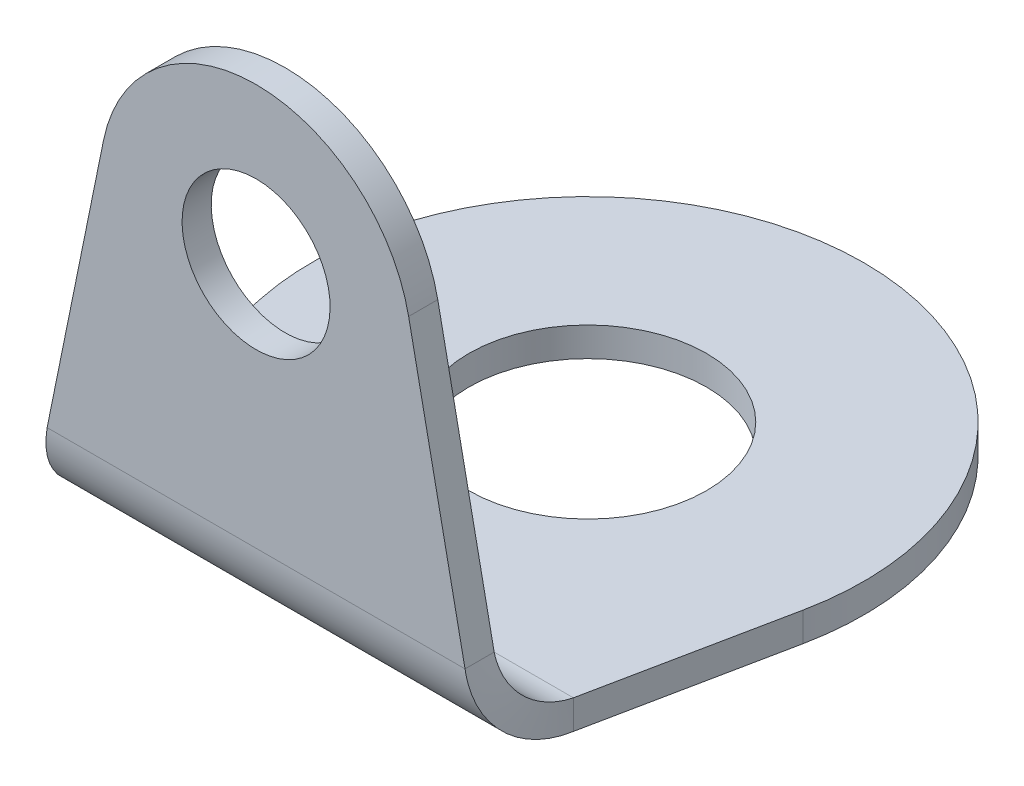
ISO-10303-21;
HEADER;
FILE_DESCRIPTION(('STEP AP214'),'2;1');
FILE_NAME('part.step','',(''),(''),'','','');
FILE_SCHEMA(('AUTOMOTIVE_DESIGN { 1 0 10303 214 1 1 1 1 }'));
ENDSEC;
DATA;
#1=APPLICATION_CONTEXT('core data for automotive mechanical design processes');
#2=APPLICATION_PROTOCOL_DEFINITION('international standard','automotive_design',2000,#1);
#3=PRODUCT_CONTEXT('',#1,'mechanical');
#4=PRODUCT('Part','Part','',(#3));
#5=PRODUCT_RELATED_PRODUCT_CATEGORY('part','',(#4));
#6=PRODUCT_DEFINITION_FORMATION('','',#4);
#7=PRODUCT_DEFINITION_CONTEXT('part definition',#1,'design');
#8=PRODUCT_DEFINITION('design','',#6,#7);
#9=PRODUCT_DEFINITION_SHAPE('','',#8);
#10=(LENGTH_UNIT() NAMED_UNIT(*) SI_UNIT(.MILLI.,.METRE.));
#11=(NAMED_UNIT(*) PLANE_ANGLE_UNIT() SI_UNIT($,.RADIAN.));
#12=(NAMED_UNIT(*) SI_UNIT($,.STERADIAN.) SOLID_ANGLE_UNIT());
#13=UNCERTAINTY_MEASURE_WITH_UNIT(LENGTH_MEASURE(1.E-05),#10,'distance_accuracy_value','');
#14=(GEOMETRIC_REPRESENTATION_CONTEXT(3) GLOBAL_UNCERTAINTY_ASSIGNED_CONTEXT((#13)) GLOBAL_UNIT_ASSIGNED_CONTEXT((#10,
#11,#12)) REPRESENTATION_CONTEXT('',''));
#15=CARTESIAN_POINT('',(0.,0.,0.));
#16=DIRECTION('',(0.,0.,1.));
#17=DIRECTION('',(1.,0.,0.));
#18=AXIS2_PLACEMENT_3D('',#15,#16,#17);
#19=CARTESIAN_POINT('',(0.,-3.92614993820408,3.94385006179594));
#20=DIRECTION('',(0.,0.,1.));
#21=DIRECTION('',(0.,-1.,0.));
#22=AXIS2_PLACEMENT_3D('',#19,#20,#21);
#23=PLANE('',#22);
#24=CARTESIAN_POINT('',(0.,3.94385006179592,3.94385006179591));
#25=DIRECTION('',(0.,0.,-1.));
#26=DIRECTION('',(0.,1.,0.));
#27=AXIS2_PLACEMENT_3D('',#24,#25,#26);
#28=CIRCLE('',#27,0.965);
#29=CARTESIAN_POINT('',(0.,4.90885006179592,3.94385006179591));
#30=VERTEX_POINT('',#29);
#31=EDGE_CURVE('E23',#30,#30,#28,.F.);
#32=ORIENTED_EDGE('',*,*,#31,.T.);
#33=EDGE_LOOP('',(#32));
#34=FACE_BOUND('',#33,.T.);
#35=DIRECTION('',(-0.199491740787802,-0.979899507785085,0.));
#36=VECTOR('',#35,1.);
#37=CARTESIAN_POINT('',(-3.52763822802631,-3.20797967136799,3.94385006179591));
#38=LINE('',#37,#36);
#39=CARTESIAN_POINT('',(-1.98919600080372,4.34881829559516,3.94385006179591));
#40=VERTEX_POINT('',#39);
#41=CARTESIAN_POINT('',(-2.72458540570571,0.736600000000003,3.94385006179592));
#42=VERTEX_POINT('',#41);
#43=EDGE_CURVE('E83',#40,#42,#38,.T.);
#44=ORIENTED_EDGE('',*,*,#43,.F.);
#45=CARTESIAN_POINT('',(0.,3.94385006179592,3.94385006179591));
#46=DIRECTION('',(0.,0.,-1.));
#47=DIRECTION('',(0.,1.,0.));
#48=AXIS2_PLACEMENT_3D('',#45,#46,#47);
#49=CIRCLE('',#48,2.03);
#50=CARTESIAN_POINT('',(1.98919600080372,4.34881829559516,3.94385006179592));
#51=VERTEX_POINT('',#50);
#52=EDGE_CURVE('E86',#51,#40,#49,.F.);
#53=ORIENTED_EDGE('',*,*,#52,.F.);
#54=DIRECTION('',(-0.199491740787802,0.979899507785085,0.));
#55=VECTOR('',#54,1.);
#56=CARTESIAN_POINT('',(3.52763822802631,-3.20797967136799,3.94385006179592));
#57=LINE('',#56,#55);
#58=CARTESIAN_POINT('',(2.72458540570571,0.7366,3.94385006179592));
#59=VERTEX_POINT('',#58);
#60=EDGE_CURVE('E88',#59,#51,#57,.T.);
#61=ORIENTED_EDGE('',*,*,#60,.F.);
#62=DIRECTION('',(-1.,0.,0.));
#63=VECTOR('',#62,1.);
#64=CARTESIAN_POINT('',(6.22625638232033,0.7366,3.94385006179592));
#65=LINE('',#64,#63);
#66=EDGE_CURVE('E117',#59,#42,#65,.T.);
#67=ORIENTED_EDGE('',*,*,#66,.T.);
#68=EDGE_LOOP('',(#44,#53,#61,#67));
#69=FACE_BOUND('',#68,.T.);
#70=ADVANCED_FACE('F17',(#34,#69),#23,.F.);
#71=CARTESIAN_POINT('',(0.,3.94385006179592,4.32385006179591));
#72=DIRECTION('',(0.,0.,-1.));
#73=DIRECTION('',(0.,1.,0.));
#74=AXIS2_PLACEMENT_3D('',#71,#72,#73);
#75=CYLINDRICAL_SURFACE('',#74,0.965);
#76=ORIENTED_EDGE('',*,*,#31,.F.);
#77=EDGE_LOOP('',(#76));
#78=FACE_BOUND('',#77,.T.);
#79=CARTESIAN_POINT('',(0.,3.94385006179592,4.32385006179591));
#80=DIRECTION('',(0.,0.,-1.));
#81=DIRECTION('',(0.,1.,0.));
#82=AXIS2_PLACEMENT_3D('',#79,#80,#81);
#83=CIRCLE('',#82,0.965);
#84=CARTESIAN_POINT('',(0.,4.90885006179592,4.32385006179591));
#85=VERTEX_POINT('',#84);
#86=EDGE_CURVE('E161',#85,#85,#83,.T.);
#87=ORIENTED_EDGE('',*,*,#86,.F.);
#88=EDGE_LOOP('',(#87));
#89=FACE_BOUND('',#88,.T.);
#90=ADVANCED_FACE('F260',(#78,#89),#75,.F.);
#91=CARTESIAN_POINT('',(-3.52763822802631,-3.20797967136799,4.32385006179594));
#92=DIRECTION('',(-0.979899507785085,0.199491740787802,0.));
#93=DIRECTION('',(-0.199491740787802,-0.979899507785085,0.));
#94=AXIS2_PLACEMENT_3D('',#91,#92,#93);
#95=PLANE('',#94);
#96=DIRECTION('',(-0.199491740787801,-0.979899507785085,0.));
#97=VECTOR('',#96,1.);
#98=CARTESIAN_POINT('',(-1.98919600080372,4.34881829559516,4.32385006179591));
#99=LINE('',#98,#97);
#100=CARTESIAN_POINT('',(-1.98919600080372,4.34881829559516,4.32385006179591));
#101=VERTEX_POINT('',#100);
#102=CARTESIAN_POINT('',(-2.72458540570571,0.736600000000003,4.32385006179592));
#103=VERTEX_POINT('',#102);
#104=EDGE_CURVE('E152',#101,#103,#99,.T.);
#105=ORIENTED_EDGE('',*,*,#104,.F.);
#106=DIRECTION('',(0.,0.,-1.));
#107=VECTOR('',#106,1.);
#108=CARTESIAN_POINT('',(-1.98919600080372,4.34881829559516,4.32385006179591));
#109=LINE('',#108,#107);
#110=EDGE_CURVE('E93',#40,#101,#109,.F.);
#111=ORIENTED_EDGE('',*,*,#110,.F.);
#112=ORIENTED_EDGE('',*,*,#43,.T.);
#113=DIRECTION('',(0.,0.,1.));
#114=VECTOR('',#113,1.);
#115=CARTESIAN_POINT('',(-2.72458540570571,0.736600000000006,4.32385006179594));
#116=LINE('',#115,#114);
#117=EDGE_CURVE('E103',#42,#103,#116,.T.);
#118=ORIENTED_EDGE('',*,*,#117,.T.);
#119=EDGE_LOOP('',(#105,#111,#112,#118));
#120=FACE_BOUND('',#119,.T.);
#121=ADVANCED_FACE('F255',(#120),#95,.T.);
#122=CARTESIAN_POINT('',(3.52763822802631,-3.20797967136799,4.32385006179594));
#123=DIRECTION('',(0.979899507785085,0.199491740787802,0.));
#124=DIRECTION('',(-0.199491740787802,0.979899507785085,0.));
#125=AXIS2_PLACEMENT_3D('',#122,#123,#124);
#126=PLANE('',#125);
#127=ORIENTED_EDGE('',*,*,#60,.T.);
#128=DIRECTION('',(0.,0.,-1.));
#129=VECTOR('',#128,1.);
#130=CARTESIAN_POINT('',(1.98919600080372,4.34881829559516,4.32385006179591));
#131=LINE('',#130,#129);
#132=CARTESIAN_POINT('',(1.98919600080372,4.34881829559516,4.32385006179591));
#133=VERTEX_POINT('',#132);
#134=EDGE_CURVE('E94',#133,#51,#131,.T.);
#135=ORIENTED_EDGE('',*,*,#134,.F.);
#136=DIRECTION('',(-0.199491740787802,0.979899507785085,0.));
#137=VECTOR('',#136,1.);
#138=CARTESIAN_POINT('',(2.72458540570571,0.736600000000004,4.32385006179592));
#139=LINE('',#138,#137);
#140=CARTESIAN_POINT('',(2.72458540570571,0.736600000000002,4.32385006179592));
#141=VERTEX_POINT('',#140);
#142=EDGE_CURVE('E154',#141,#133,#139,.T.);
#143=ORIENTED_EDGE('',*,*,#142,.F.);
#144=DIRECTION('',(0.,0.,1.));
#145=VECTOR('',#144,1.);
#146=CARTESIAN_POINT('',(2.72458540570571,0.7366,4.13385006179592));
#147=LINE('',#146,#145);
#148=EDGE_CURVE('E101',#59,#141,#147,.T.);
#149=ORIENTED_EDGE('',*,*,#148,.F.);
#150=EDGE_LOOP('',(#127,#135,#143,#149));
#151=FACE_BOUND('',#150,.T.);
#152=ADVANCED_FACE('F98',(#151),#126,.T.);
#153=CARTESIAN_POINT('',(0.,3.94385006179592,4.32385006179591));
#154=DIRECTION('',(0.,0.,-1.));
#155=DIRECTION('',(0.,1.,0.));
#156=AXIS2_PLACEMENT_3D('',#153,#154,#155);
#157=CYLINDRICAL_SURFACE('',#156,2.03);
#158=ORIENTED_EDGE('',*,*,#52,.T.);
#159=ORIENTED_EDGE('',*,*,#110,.T.);
#160=CARTESIAN_POINT('',(0.,3.94385006179592,4.32385006179591));
#161=DIRECTION('',(0.,0.,-1.));
#162=DIRECTION('',(0.,1.,0.));
#163=AXIS2_PLACEMENT_3D('',#160,#161,#162);
#164=CIRCLE('',#163,2.03);
#165=EDGE_CURVE('E107',#133,#101,#164,.F.);
#166=ORIENTED_EDGE('',*,*,#165,.F.);
#167=ORIENTED_EDGE('',*,*,#134,.T.);
#168=EDGE_LOOP('',(#158,#159,#166,#167));
#169=FACE_BOUND('',#168,.T.);
#170=ADVANCED_FACE('F105',(#169),#157,.T.);
#171=CARTESIAN_POINT('',(6.22625638232033,0.7366,3.20725006179592));
#172=DIRECTION('',(-1.,0.,0.));
#173=DIRECTION('',(0.,0.,1.));
#174=AXIS2_PLACEMENT_3D('',#171,#172,#173);
#175=CYLINDRICAL_SURFACE('',#174,0.7366);
#176=CARTESIAN_POINT('',(-2.7245854057057,0.7366,3.94385006179592));
#177=CARTESIAN_POINT('',(-2.72767203391088,0.724547398513028,3.94385031746151));
#178=CARTESIAN_POINT('',(-2.73075866211606,0.712494818780693,3.94355425585031));
#179=CARTESIAN_POINT('',(-2.73693191852642,0.688418683400155,3.942371333823));
#180=CARTESIAN_POINT('',(-2.74001854673159,0.676395127751952,3.94148447340688));
#181=CARTESIAN_POINT('',(-2.74619180314195,0.652406021114539,3.93912178951844));
#182=CARTESIAN_POINT('',(-2.74927843134713,0.640440470125329,3.93764596604611));
#183=CARTESIAN_POINT('',(-2.75545168775749,0.616596194907032,3.93410899202585));
#184=CARTESIAN_POINT('',(-2.75853831596266,0.604717470677944,3.93204784147792));
#185=CARTESIAN_POINT('',(-2.76471157237302,0.581075466927895,3.92734515720396));
#186=CARTESIAN_POINT('',(-2.7677982005782,0.569312187406933,3.92470362347792));
#187=CARTESIAN_POINT('',(-2.77397145698856,0.545929411559579,3.91884654232013));
#188=CARTESIAN_POINT('',(-2.77705808519373,0.534309915233187,3.91563099488838));
#189=CARTESIAN_POINT('',(-2.78323134160409,0.511242698235539,3.90863363130415));
#190=CARTESIAN_POINT('',(-2.78631796980927,0.499794977564283,3.90485181515168));
#191=CARTESIAN_POINT('',(-2.79249122621963,0.477098890418298,3.89673102526779));
#192=CARTESIAN_POINT('',(-2.7955778544248,0.465850523943568,3.89239205153638));
#193=CARTESIAN_POINT('',(-2.80175111083516,0.443580243496181,3.88316739935109));
#194=CARTESIAN_POINT('',(-2.80483773904034,0.432558329523524,3.8782817208972));
#195=CARTESIAN_POINT('',(-2.81101099545069,0.410767506834983,3.8679754293241));
#196=CARTESIAN_POINT('',(-2.81409762365587,0.3999985981191,3.86255481620489));
#197=CARTESIAN_POINT('',(-2.82027088006623,0.37873972918884,3.85119171402495));
#198=CARTESIAN_POINT('',(-2.82335750827141,0.368249768974464,3.84524922496422));
#199=CARTESIAN_POINT('',(-2.82953076468177,0.347574068280082,3.83285668688003));
#200=CARTESIAN_POINT('',(-2.83261739288694,0.337388327800076,3.82640663785656));
#201=CARTESIAN_POINT('',(-2.8387906492973,0.317345604915445,3.81301451857939));
#202=CARTESIAN_POINT('',(-2.84187727750248,0.30748862251082,3.80607244832568));
#203=CARTESIAN_POINT('',(-2.84805053391284,0.288127162110926,3.79171301064345));
#204=CARTESIAN_POINT('',(-2.85113716211801,0.278622684115657,3.78429564321494));
#205=CARTESIAN_POINT('',(-2.85731041852837,0.25998912965446,3.76900348027089));
#206=CARTESIAN_POINT('',(-2.86039704673355,0.250860053188533,3.76112868475535));
#207=CARTESIAN_POINT('',(-2.86657030314391,0.232999294530839,3.74494063670942));
#208=CARTESIAN_POINT('',(-2.86965693134908,0.224267612339072,3.73662738417902));
#209=CARTESIAN_POINT('',(-2.87583018775944,0.207222677616905,3.71958244945685));
#210=CARTESIAN_POINT('',(-2.87891681596462,0.198909425086505,3.71085076726508));
#211=CARTESIAN_POINT('',(-2.88509007237497,0.182721377040568,3.69299000860739));
#212=CARTESIAN_POINT('',(-2.88817670058015,0.174846581525032,3.68386093214146));
#213=CARTESIAN_POINT('',(-2.89434995699051,0.159554418580983,3.66522737768026));
#214=CARTESIAN_POINT('',(-2.89743658519569,0.152137051152469,3.655722899685));
#215=CARTESIAN_POINT('',(-2.90360984160604,0.137777613470244,3.6363614392851));
#216=CARTESIAN_POINT('',(-2.90669646981122,0.130835543216532,3.62650445688048));
#217=CARTESIAN_POINT('',(-2.91286972622158,0.117443423939358,3.60646173399585));
#218=CARTESIAN_POINT('',(-2.91595635442676,0.110993374915896,3.59627599351584));
#219=CARTESIAN_POINT('',(-2.92212961083711,0.0986008368317028,3.57560029282146));
#220=CARTESIAN_POINT('',(-2.92521623904229,0.0926583477709719,3.56511033260708));
#221=CARTESIAN_POINT('',(-2.93138949545265,0.0812952455910308,3.54385146367682));
#222=CARTESIAN_POINT('',(-2.93447612365783,0.0758746324718206,3.53308255496094));
#223=CARTESIAN_POINT('',(-2.94064938006819,0.0655683408987223,3.5112917322724));
#224=CARTESIAN_POINT('',(-2.94373600827336,0.0606826624448342,3.50026981829974));
#225=CARTESIAN_POINT('',(-2.94990926468372,0.0514580102595376,3.47799953785235));
#226=CARTESIAN_POINT('',(-2.9529958928889,0.0471190365281292,3.46675117137762));
#227=CARTESIAN_POINT('',(-2.95916914929926,0.038998246644244,3.44405508423164));
#228=CARTESIAN_POINT('',(-2.96225577750443,0.0352164304917673,3.43260736356038));
#229=CARTESIAN_POINT('',(-2.96842903391479,0.0282190669075419,3.40954014656274));
#230=CARTESIAN_POINT('',(-2.97151566211997,0.0250035194757932,3.39792065023634));
#231=CARTESIAN_POINT('',(-2.97768891853033,0.019146438318004,3.37453787438899));
#232=CARTESIAN_POINT('',(-2.9807755467355,0.0165049045919635,3.36277459486803));
#233=CARTESIAN_POINT('',(-2.98694880314586,0.011802220317997,3.33913259111798));
#234=CARTESIAN_POINT('',(-2.99003543135104,0.00974106977007098,3.32725386688889));
#235=CARTESIAN_POINT('',(-2.99620868776139,0.00620409574981292,3.30340959167059));
#236=CARTESIAN_POINT('',(-2.99929531596657,0.00472827227748086,3.29144404068138));
#237=CARTESIAN_POINT('',(-3.00546857237693,0.00236558838903799,3.26745493404397));
#238=CARTESIAN_POINT('',(-3.00855520058211,0.00147872797292718,3.25543137839577));
#239=CARTESIAN_POINT('',(-3.01472845699247,0.000295805945612161,3.23135524301523));
#240=CARTESIAN_POINT('',(-3.01781508519764,-2.55665592057032E-07,3.21930266328289));
#241=CARTESIAN_POINT('',(-3.02090171340282,0.,3.20725006179592));
#242=B_SPLINE_CURVE_WITH_KNOTS('',3,(#176,#177,#178,#179,#180,#181,#182,#183,#184,#185,#186,
#187,#188,#189,#190,#191,#192,#193,#194,#195,#196,#197,#198,#199,#200,#201,#202,#203,#204,#205,
#206,#207,#208,#209,#210,#211,#212,#213,#214,#215,#216,#217,#218,#219,#220,#221,#222,#223,#224,
#225,#226,#227,#228,#229,#230,#231,#232,#233,#234,#235,#236,#237,#238,#239,#240,#241),
.UNSPECIFIED.,.F.,.F.,(4,2,2,2,2,2,2,2,2,2,2,2,2,2,2,2,2,2,2,2,2,2,2,2,2,2,2,2,2,2,2,2,4),(0.,
0.0373211353992559,0.0746422707985128,0.111963406197768,0.149284541597024,0.186605676996281,
0.223926812395537,0.261247947794792,0.29856908319405,0.335890218593305,0.373211353992562,
0.410532489391818,0.447853624791073,0.48517476019033,0.522495895589586,0.559817030988842,
0.597138166388098,0.634459301787355,0.671780437186611,0.709101572585867,0.746422707985123,
0.783743843384379,0.821064978783635,0.858386114182891,0.895707249582147,0.933028384981404,
0.97034952038066,1.00767065577992,1.04499179117917,1.08231292657843,1.11963406197768,
1.15695519737694,1.1942763327762),.UNSPECIFIED.);
#243=CARTESIAN_POINT('',(-3.02090171340282,0.,3.20725006179592));
#244=VERTEX_POINT('',#243);
#245=EDGE_CURVE('E135',#42,#244,#242,.T.);
#246=ORIENTED_EDGE('',*,*,#245,.F.);
#247=ORIENTED_EDGE('',*,*,#66,.F.);
#248=CARTESIAN_POINT('',(3.02090171340282,0.,3.20725006179592));
#249=CARTESIAN_POINT('',(3.01781508519764,-2.55665592075732E-07,3.21930266328289));
#250=CARTESIAN_POINT('',(3.01472845699247,0.000295805945612146,3.23135524301523));
#251=CARTESIAN_POINT('',(3.00855520058211,0.00147872797292718,3.25543137839577));
#252=CARTESIAN_POINT('',(3.00546857237693,0.002365588389038,3.26745493404397));
#253=CARTESIAN_POINT('',(2.99929531596658,0.00472827227748087,3.29144404068138));
#254=CARTESIAN_POINT('',(2.9962086877614,0.00620409574981294,3.30340959167059));
#255=CARTESIAN_POINT('',(2.99003543135104,0.00974106977007097,3.32725386688889));
#256=CARTESIAN_POINT('',(2.98694880314586,0.0118022203179969,3.33913259111798));
#257=CARTESIAN_POINT('',(2.98077554673551,0.0165049045919634,3.36277459486803));
#258=CARTESIAN_POINT('',(2.97768891853033,0.019146438318004,3.37453787438899));
#259=CARTESIAN_POINT('',(2.97151566211997,0.0250035194757932,3.39792065023634));
#260=CARTESIAN_POINT('',(2.96842903391479,0.0282190669075419,3.40954014656274));
#261=CARTESIAN_POINT('',(2.96225577750444,0.0352164304917673,3.43260736356038));
#262=CARTESIAN_POINT('',(2.95916914929926,0.038998246644244,3.44405508423164));
#263=CARTESIAN_POINT('',(2.9529958928889,0.0471190365281292,3.46675117137762));
#264=CARTESIAN_POINT('',(2.94990926468372,0.0514580102595377,3.47799953785235));
#265=CARTESIAN_POINT('',(2.94373600827337,0.0606826624448342,3.50026981829974));
#266=CARTESIAN_POINT('',(2.94064938006819,0.0655683408987222,3.5112917322724));
#267=CARTESIAN_POINT('',(2.93447612365783,0.0758746324718205,3.53308255496094));
#268=CARTESIAN_POINT('',(2.93138949545265,0.0812952455910308,3.54385146367682));
#269=CARTESIAN_POINT('',(2.9252162390423,0.092658347770972,3.56511033260708));
#270=CARTESIAN_POINT('',(2.92212961083712,0.0986008368317028,3.57560029282146));
#271=CARTESIAN_POINT('',(2.91595635442676,0.110993374915896,3.59627599351584));
#272=CARTESIAN_POINT('',(2.91286972622158,0.117443423939358,3.60646173399585));
#273=CARTESIAN_POINT('',(2.90669646981123,0.130835543216532,3.62650445688048));
#274=CARTESIAN_POINT('',(2.90360984160605,0.137777613470244,3.6363614392851));
#275=CARTESIAN_POINT('',(2.89743658519569,0.152137051152469,3.655722899685));
#276=CARTESIAN_POINT('',(2.89434995699051,0.159554418580983,3.66522737768026));
#277=CARTESIAN_POINT('',(2.88817670058016,0.174846581525032,3.68386093214146));
#278=CARTESIAN_POINT('',(2.88509007237498,0.182721377040568,3.69299000860739));
#279=CARTESIAN_POINT('',(2.87891681596462,0.198909425086505,3.71085076726508));
#280=CARTESIAN_POINT('',(2.87583018775944,0.207222677616905,3.71958244945685));
#281=CARTESIAN_POINT('',(2.86965693134909,0.224267612339072,3.73662738417902));
#282=CARTESIAN_POINT('',(2.86657030314391,0.232999294530839,3.74494063670942));
#283=CARTESIAN_POINT('',(2.86039704673355,0.250860053188533,3.76112868475535));
#284=CARTESIAN_POINT('',(2.85731041852837,0.25998912965446,3.76900348027089));
#285=CARTESIAN_POINT('',(2.85113716211802,0.278622684115657,3.78429564321494));
#286=CARTESIAN_POINT('',(2.84805053391284,0.288127162110926,3.79171301064345));
#287=CARTESIAN_POINT('',(2.84187727750248,0.30748862251082,3.80607244832568));
#288=CARTESIAN_POINT('',(2.83879064929731,0.317345604915445,3.81301451857939));
#289=CARTESIAN_POINT('',(2.83261739288695,0.337388327800076,3.82640663785656));
#290=CARTESIAN_POINT('',(2.82953076468177,0.347574068280082,3.83285668688003));
#291=CARTESIAN_POINT('',(2.82335750827141,0.368249768974464,3.84524922496422));
#292=CARTESIAN_POINT('',(2.82027088006624,0.37873972918884,3.85119171402495));
#293=CARTESIAN_POINT('',(2.81409762365588,0.3999985981191,3.86255481620489));
#294=CARTESIAN_POINT('',(2.8110109954507,0.410767506834984,3.8679754293241));
#295=CARTESIAN_POINT('',(2.80483773904034,0.432558329523524,3.8782817208972));
#296=CARTESIAN_POINT('',(2.80175111083517,0.443580243496181,3.88316739935109));
#297=CARTESIAN_POINT('',(2.79557785442481,0.465850523943568,3.89239205153638));
#298=CARTESIAN_POINT('',(2.79249122621963,0.477098890418298,3.89673102526779));
#299=CARTESIAN_POINT('',(2.78631796980927,0.499794977564283,3.90485181515168));
#300=CARTESIAN_POINT('',(2.7832313416041,0.511242698235539,3.90863363130415));
#301=CARTESIAN_POINT('',(2.77705808519374,0.534309915233187,3.91563099488838));
#302=CARTESIAN_POINT('',(2.77397145698856,0.545929411559579,3.91884654232013));
#303=CARTESIAN_POINT('',(2.76779820057821,0.569312187406933,3.92470362347792));
#304=CARTESIAN_POINT('',(2.76471157237303,0.581075466927895,3.92734515720396));
#305=CARTESIAN_POINT('',(2.75853831596267,0.604717470677945,3.93204784147792));
#306=CARTESIAN_POINT('',(2.75545168775749,0.616596194907032,3.93410899202585));
#307=CARTESIAN_POINT('',(2.74927843134714,0.640440470125329,3.93764596604611));
#308=CARTESIAN_POINT('',(2.74619180314196,0.652406021114539,3.93912178951844));
#309=CARTESIAN_POINT('',(2.7400185467316,0.676395127751952,3.94148447340688));
#310=CARTESIAN_POINT('',(2.73693191852642,0.688418683400155,3.942371333823));
#311=CARTESIAN_POINT('',(2.73075866211607,0.712494818780693,3.94355425585031));
#312=CARTESIAN_POINT('',(2.72767203391089,0.724547398513028,3.94385031746151));
#313=CARTESIAN_POINT('',(2.72458540570571,0.7366,3.94385006179592));
#314=B_SPLINE_CURVE_WITH_KNOTS('',3,(#248,#249,#250,#251,#252,#253,#254,#255,#256,#257,#258,
#259,#260,#261,#262,#263,#264,#265,#266,#267,#268,#269,#270,#271,#272,#273,#274,#275,#276,#277,
#278,#279,#280,#281,#282,#283,#284,#285,#286,#287,#288,#289,#290,#291,#292,#293,#294,#295,#296,
#297,#298,#299,#300,#301,#302,#303,#304,#305,#306,#307,#308,#309,#310,#311,#312,#313),
.UNSPECIFIED.,.F.,.F.,(4,2,2,2,2,2,2,2,2,2,2,2,2,2,2,2,2,2,2,2,2,2,2,2,2,2,2,2,2,2,2,2,4),(0.,
0.0373211353992559,0.0746422707985117,0.111963406197768,0.149284541597024,0.186605676996281,
0.223926812395536,0.261247947794792,0.298569083194049,0.335890218593305,0.373211353992561,
0.410532489391817,0.447853624791073,0.485174760190329,0.522495895589585,0.559817030988841,
0.597138166388097,0.634459301787354,0.67178043718661,0.709101572585865,0.746422707985122,
0.783743843384378,0.821064978783634,0.85838611418289,0.895707249582146,0.933028384981403,
0.970349520380658,1.00767065577991,1.04499179117917,1.08231292657843,1.11963406197768,
1.15695519737694,1.19427633277619),.UNSPECIFIED.);
#315=CARTESIAN_POINT('',(3.02090171340282,0.,3.20725006179592));
#316=VERTEX_POINT('',#315);
#317=EDGE_CURVE('E113',#316,#59,#314,.T.);
#318=ORIENTED_EDGE('',*,*,#317,.F.);
#319=DIRECTION('',(1.,0.,0.));
#320=VECTOR('',#319,1.);
#321=CARTESIAN_POINT('',(0.,0.,3.20725006179592));
#322=LINE('',#321,#320);
#323=EDGE_CURVE('E170',#316,#244,#322,.F.);
#324=ORIENTED_EDGE('',*,*,#323,.T.);
#325=EDGE_LOOP('',(#246,#247,#318,#324));
#326=FACE_BOUND('',#325,.T.);
#327=ADVANCED_FACE('F118',(#326),#175,.F.);
#328=CARTESIAN_POINT('',(3.02090171340283,-0.3838,3.20725006179592));
#329=CARTESIAN_POINT('',(2.99620435771423,-0.3838,3.35393579335656));
#330=CARTESIAN_POINT('',(2.97151566211997,-0.354638986939181,3.50051239143206));
#331=CARTESIAN_POINT('',(2.92212961083712,-0.24239026951211,3.77150476740348));
#332=CARTESIAN_POINT('',(2.89743658519569,-0.159346730222921,3.89578820685582));
#333=CARTESIAN_POINT('',(2.84805053391284,0.0480618549401053,4.10319679201884));
#334=CARTESIAN_POINT('',(2.82335750827142,0.172345294392444,4.18624033130803));
#335=CARTESIAN_POINT('',(2.77397145698856,0.443337670363862,4.2984890487351));
#336=CARTESIAN_POINT('',(2.7492827613943,0.58991426843936,4.32765006179592));
#337=CARTESIAN_POINT('',(2.72458540570571,0.7366,4.32765006179592));
#338=CARTESIAN_POINT('',(3.02090171340283,-0.38,3.20725006179592));
#339=CARTESIAN_POINT('',(2.99620435921901,-0.38,3.35343828144933));
#340=CARTESIAN_POINT('',(2.97151566211997,-0.350937890767841,3.49951774947149));
#341=CARTESIAN_POINT('',(2.92212961083712,-0.239069881236364,3.76959101527807));
#342=CARTESIAN_POINT('',(2.89743658519569,-0.156307996221808,3.89345292931991));
#343=CARTESIAN_POINT('',(2.84805053391284,0.0503971324760099,4.10015805801773));
#344=CARTESIAN_POINT('',(2.82335750827142,0.174259046517853,4.18291994303229));
#345=CARTESIAN_POINT('',(2.77397145698856,0.444332312324427,4.29478795256376));
#346=CARTESIAN_POINT('',(2.74928275988953,0.590411780346592,4.32385006179592));
#347=CARTESIAN_POINT('',(2.72458540570571,0.7366,4.32385006179592));
#348=CARTESIAN_POINT('',(3.02090171340283,0.,3.20725006179592));
#349=CARTESIAN_POINT('',(2.99620450969664,0.,3.30368709072608));
#350=CARTESIAN_POINT('',(2.97151566211997,0.019171726366119,3.40005355341497));
#351=CARTESIAN_POINT('',(2.92212961083712,0.0929689463382539,3.57821580273713));
#352=CARTESIAN_POINT('',(2.8974365851957,0.147565403889501,3.65992517572944));
#353=CARTESIAN_POINT('',(2.84805053391284,0.283924886066478,3.79628465790642));
#354=CARTESIAN_POINT('',(2.82335750827142,0.365634259058795,3.85088111545767));
#355=CARTESIAN_POINT('',(2.77397145698857,0.543796508380954,3.9246783354298));
#356=CARTESIAN_POINT('',(2.7492826094119,0.640162971069842,3.94385006179592));
#357=CARTESIAN_POINT('',(2.72458540570571,0.7366,3.94385006179592));
#358=CARTESIAN_POINT('',(3.02090171340283,0.00383800000000022,3.20725006179592));
#359=CARTESIAN_POINT('',(2.99620451121646,0.00383800000000018,3.30318460369977));
#360=CARTESIAN_POINT('',(2.97151566211997,0.022909833499172,3.3990489650348));
#361=CARTESIAN_POINT('',(2.92212961083712,0.0963225384967575,3.57628291309046));
#362=CARTESIAN_POINT('',(2.8974365851957,0.150634525230625,3.65756654541818));
#363=CARTESIAN_POINT('',(2.84805053391284,0.286283516377741,3.7932155365653));
#364=CARTESIAN_POINT('',(2.82335750827142,0.367567148705459,3.84752752329917));
#365=CARTESIAN_POINT('',(2.77397145698857,0.544801096761125,3.92094022829675));
#366=CARTESIAN_POINT('',(2.74928260789208,0.640665458096147,3.94001206179592));
#367=CARTESIAN_POINT('',(2.72458540570571,0.7366,3.94001206179592));
#368=B_SPLINE_SURFACE_WITH_KNOTS('',1,3,((#328,#329,#330,#331,#332,#333,#334,#335,#336,#337),
(#338,#339,#340,#341,#342,#343,#344,#345,#346,#347),(#348,#349,#350,#351,#352,#353,#354,#355,
#356,#357),(#358,#359,#360,#361,#362,#363,#364,#365,#366,#367)),.UNSPECIFIED.,.F.,.F.,.F.,(2,1,
1,2),(4,2,2,2,4),(-0.01,0.,1.,1.0101),(0.,0.25,0.5,0.75,1.),.UNSPECIFIED.);
#369=CARTESIAN_POINT('',(3.02090171340282,-0.38,3.20725006179592));
#370=CARTESIAN_POINT('',(3.01781508519764,-0.380000387559326,3.22552040502203));
#371=CARTESIAN_POINT('',(3.01472845699247,-0.379551592561945,3.24379071527064));
#372=CARTESIAN_POINT('',(3.00855520058211,-0.377758420235445,3.28028733862919));
#373=CARTESIAN_POINT('',(3.00546857237693,-0.376414042906326,3.29851365173913));
#374=CARTESIAN_POINT('',(2.99929531596658,-0.372832488698024,3.33487834963668));
#375=CARTESIAN_POINT('',(2.9962086877614,-0.370595311818841,3.35301673442429));
#376=CARTESIAN_POINT('',(2.99003543135104,-0.365233670234508,3.38916188472127));
#377=CARTESIAN_POINT('',(2.98694880314586,-0.362109205529357,3.40716865023063));
#378=CARTESIAN_POINT('',(2.98077554673551,-0.354980482667137,3.44300718048763));
#379=CARTESIAN_POINT('',(2.97768891853033,-0.350976224510068,3.46083894523526));
#380=CARTESIAN_POINT('',(2.97151566211997,-0.342097570123987,3.49628451611655));
#381=CARTESIAN_POINT('',(2.96842903391479,-0.337223173894974,3.5138983222502));
#382=CARTESIAN_POINT('',(2.96225577750444,-0.326615983862194,3.54886554258631));
#383=CARTESIAN_POINT('',(2.95916914929926,-0.320883190058426,3.56621895678876));
#384=CARTESIAN_POINT('',(2.9529958928889,-0.308573016308296,3.60062358739859));
#385=CARTESIAN_POINT('',(2.94990926468372,-0.301995636361933,3.61767480380598));
#386=CARTESIAN_POINT('',(2.94373600827337,-0.288012135642272,3.65143396094358));
#387=CARTESIAN_POINT('',(2.94064938006819,-0.280606014868974,3.66814190167378));
#388=CARTESIAN_POINT('',(2.93447612365783,-0.264982874534299,3.70117425656657));
#389=CARTESIAN_POINT('',(2.93138949545265,-0.256765854972922,3.71749867072915));
#390=CARTESIAN_POINT('',(2.9252162390423,-0.239540712569824,3.74972464554252));
#391=CARTESIAN_POINT('',(2.92212961083712,-0.230532589728102,3.76562620619331));
#392=CARTESIAN_POINT('',(2.91595635442676,-0.211746942124505,3.79696816573084));
#393=CARTESIAN_POINT('',(2.91286972622158,-0.201969417362629,3.81240856461758));
#394=CARTESIAN_POINT('',(2.90669646981123,-0.181668520831415,3.84279100335364));
#395=CARTESIAN_POINT('',(2.90360984160605,-0.171145149062076,3.85773304320295));
#396=CARTESIAN_POINT('',(2.89743658519569,-0.1493779102405,3.88708276718139));
#397=CARTESIAN_POINT('',(2.89434995699051,-0.138134043188263,3.90149045131053));
#398=CARTESIAN_POINT('',(2.88817670058016,-0.114952901261402,3.92973675447557));
#399=CARTESIAN_POINT('',(2.88509007237498,-0.103015626386779,3.94357537351149));
#400=CARTESIAN_POINT('',(2.87891681596462,-0.078476426755917,3.97065020804472));
#401=CARTESIAN_POINT('',(2.87583018775945,-0.0658745019996787,3.98388642354204));
#402=CARTESIAN_POINT('',(2.86965693134909,-0.0400363617461192,4.0097245637956));
#403=CARTESIAN_POINT('',(2.86657030314391,-0.026800146248798,4.02232648855184));
#404=CARTESIAN_POINT('',(2.86039704673355,0.000274688284437368,4.0468656881827));
#405=CARTESIAN_POINT('',(2.85731041852838,0.0141133073203515,4.05880296305732));
#406=CARTESIAN_POINT('',(2.85113716211802,0.0423596104853961,4.08198410498418));
#407=CARTESIAN_POINT('',(2.84805053391284,0.0567672946145267,4.09322797203642));
#408=CARTESIAN_POINT('',(2.84187727750249,0.0861170185929708,4.114995210858));
#409=CARTESIAN_POINT('',(2.83879064929731,0.101059058442284,4.12551858262734));
#410=CARTESIAN_POINT('',(2.83261739288695,0.13144149717834,4.14581947915855));
#411=CARTESIAN_POINT('',(2.82953076468177,0.146881896065082,4.15559700392043));
#412=CARTESIAN_POINT('',(2.82335750827142,0.178223855602615,4.17438265152402));
#413=CARTESIAN_POINT('',(2.82027088006624,0.194125416253406,4.18339077436575));
#414=CARTESIAN_POINT('',(2.81409762365588,0.226351391066776,4.20061591676884));
#415=CARTESIAN_POINT('',(2.8110109954507,0.242675805229355,4.20883293633022));
#416=CARTESIAN_POINT('',(2.80483773904035,0.275708160122138,4.2244560766649));
#417=CARTESIAN_POINT('',(2.80175111083517,0.292416100852343,4.23186219743819));
#418=CARTESIAN_POINT('',(2.79557785442481,0.326175257989938,4.24584569815786));
#419=CARTESIAN_POINT('',(2.79249122621963,0.343226474397328,4.25242307810422));
#420=CARTESIAN_POINT('',(2.78631796980928,0.377631105007167,4.26473325185435));
#421=CARTESIAN_POINT('',(2.7832313416041,0.394984519209616,4.27046604565812));
#422=CARTESIAN_POINT('',(2.77705808519374,0.429951739545719,4.2810732356909));
#423=CARTESIAN_POINT('',(2.77397145698856,0.447565545679372,4.28594763191991));
#424=CARTESIAN_POINT('',(2.76779820057821,0.483011116560659,4.29482628630599));
#425=CARTESIAN_POINT('',(2.76471157237303,0.500842881308292,4.29883054446306));
#426=CARTESIAN_POINT('',(2.75853831596267,0.53668141156529,4.30595926732528));
#427=CARTESIAN_POINT('',(2.75545168775749,0.554688177074656,4.30908373203043));
#428=CARTESIAN_POINT('',(2.74927843134714,0.59083332737163,4.31444537361476));
#429=CARTESIAN_POINT('',(2.74619180314196,0.608971712159237,4.31668255049395));
#430=CARTESIAN_POINT('',(2.7400185467316,0.645336410056787,4.32026410470225));
#431=CARTESIAN_POINT('',(2.73693191852642,0.663562723166729,4.32160848203137));
#432=CARTESIAN_POINT('',(2.73075866211607,0.700059346525281,4.32340165435787));
#433=CARTESIAN_POINT('',(2.72767203391089,0.71832965677389,4.32385044935525));
#434=CARTESIAN_POINT('',(2.72458540570571,0.7366,4.32385006179592));
#435=B_SPLINE_CURVE_WITH_KNOTS('',3,(#369,#370,#371,#372,#373,#374,#375,#376,#377,#378,#379,
#380,#381,#382,#383,#384,#385,#386,#387,#388,#389,#390,#391,#392,#393,#394,#395,#396,#397,#398,
#399,#400,#401,#402,#403,#404,#405,#406,#407,#408,#409,#410,#411,#412,#413,#414,#415,#416,#417,
#418,#419,#420,#421,#422,#423,#424,#425,#426,#427,#428,#429,#430,#431,#432,#433,#434),
.UNSPECIFIED.,.F.,.F.,(4,2,2,2,2,2,2,2,2,2,2,2,2,2,2,2,2,2,2,2,2,2,2,2,2,2,2,2,2,2,2,2,4),(0.,
0.0555822379319707,0.111164475863942,0.166746713795912,0.222328951727884,0.277911189659855,
0.333493427591826,0.389075665523797,0.444657903455768,0.50024014138774,0.55582237931971,
0.611404617251681,0.666986855183652,0.722569093115623,0.778151331047594,0.833733568979565,
0.889315806911537,0.944898044843508,1.00048028277548,1.05606252070745,1.11164475863942,
1.16722699657139,1.22280923450336,1.27839147243533,1.3339737103673,1.38955594829928,
1.44513818623125,1.50072042416322,1.55630266209519,1.61188490002716,1.66746713795913,
1.7230493758911,1.77863161382307),.UNSPECIFIED.);
#436=CARTESIAN_POINT('',(3.02090171340282,-0.38,3.20725006179592));
#437=VERTEX_POINT('',#436);
#438=EDGE_CURVE('E175',#437,#141,#435,.T.);
#439=DIRECTION('',(0.,1.,0.));
#440=VECTOR('',#439,1.);
#441=CARTESIAN_POINT('',(3.02090171340283,-0.19,3.20725006179592));
#442=LINE('',#441,#440);
#443=EDGE_CURVE('E140',#437,#316,#442,.T.);
#444=ORIENTED_EDGE('',*,*,#438,.F.);
#445=ORIENTED_EDGE('',*,*,#443,.T.);
#446=ORIENTED_EDGE('',*,*,#317,.T.);
#447=ORIENTED_EDGE('',*,*,#148,.T.);
#448=EDGE_LOOP('',(#444,#445,#446,#447));
#449=FACE_BOUND('',#448,.T.);
#450=ADVANCED_FACE('F128',(#449),#368,.T.);
#451=CARTESIAN_POINT('',(0.,-3.92614993820408,4.32385006179594));
#452=DIRECTION('',(0.,0.,1.));
#453=DIRECTION('',(0.,-1.,0.));
#454=AXIS2_PLACEMENT_3D('',#451,#452,#453);
#455=PLANE('',#454);
#456=ORIENTED_EDGE('',*,*,#142,.T.);
#457=ORIENTED_EDGE('',*,*,#165,.T.);
#458=ORIENTED_EDGE('',*,*,#104,.T.);
#459=DIRECTION('',(-1.,0.,0.));
#460=VECTOR('',#459,1.);
#461=CARTESIAN_POINT('',(6.22625638232033,0.7366,4.32385006179592));
#462=LINE('',#461,#460);
#463=EDGE_CURVE('E171',#141,#103,#462,.T.);
#464=ORIENTED_EDGE('',*,*,#463,.F.);
#465=EDGE_LOOP('',(#456,#457,#458,#464));
#466=FACE_BOUND('',#465,.T.);
#467=ORIENTED_EDGE('',*,*,#86,.T.);
#468=EDGE_LOOP('',(#467));
#469=FACE_BOUND('',#468,.T.);
#470=ADVANCED_FACE('F130',(#466,#469),#455,.T.);
#471=CARTESIAN_POINT('',(-2.7245854057057,0.7366,4.32765006179592));
#472=CARTESIAN_POINT('',(-2.74928276139429,0.58991426843936,4.32765006179592));
#473=CARTESIAN_POINT('',(-2.77397145698855,0.443337670363862,4.2984890487351));
#474=CARTESIAN_POINT('',(-2.82335750827141,0.172345294392444,4.18624033130803));
#475=CARTESIAN_POINT('',(-2.84805053391283,0.0480618549401053,4.10319679201884));
#476=CARTESIAN_POINT('',(-2.89743658519568,-0.159346730222921,3.89578820685582));
#477=CARTESIAN_POINT('',(-2.92212961083711,-0.24239026951211,3.77150476740348));
#478=CARTESIAN_POINT('',(-2.97151566211996,-0.354638986939181,3.50051239143206));
#479=CARTESIAN_POINT('',(-2.99620435771422,-0.3838,3.35393579335656));
#480=CARTESIAN_POINT('',(-3.02090171340281,-0.3838,3.20725006179592));
#481=CARTESIAN_POINT('',(-2.7245854057057,0.7366,4.32385006179592));
#482=CARTESIAN_POINT('',(-2.74928275988952,0.590411780346592,4.32385006179592));
#483=CARTESIAN_POINT('',(-2.77397145698855,0.444332312324427,4.29478795256376));
#484=CARTESIAN_POINT('',(-2.82335750827141,0.174259046517853,4.18291994303229));
#485=CARTESIAN_POINT('',(-2.84805053391283,0.0503971324760099,4.10015805801773));
#486=CARTESIAN_POINT('',(-2.89743658519568,-0.156307996221808,3.89345292931991));
#487=CARTESIAN_POINT('',(-2.92212961083711,-0.239069881236364,3.76959101527807));
#488=CARTESIAN_POINT('',(-2.97151566211996,-0.350937890767841,3.49951774947149));
#489=CARTESIAN_POINT('',(-2.996204359219,-0.38,3.35343828144933));
#490=CARTESIAN_POINT('',(-3.02090171340281,-0.38,3.20725006179592));
#491=CARTESIAN_POINT('',(-2.7245854057057,0.7366,3.94385006179592));
#492=CARTESIAN_POINT('',(-2.74928260941189,0.640162971069842,3.94385006179592));
#493=CARTESIAN_POINT('',(-2.77397145698855,0.543796508380954,3.9246783354298));
#494=CARTESIAN_POINT('',(-2.82335750827141,0.365634259058795,3.85088111545767));
#495=CARTESIAN_POINT('',(-2.84805053391283,0.283924886066478,3.79628465790642));
#496=CARTESIAN_POINT('',(-2.89743658519568,0.147565403889501,3.65992517572944));
#497=CARTESIAN_POINT('',(-2.92212961083711,0.0929689463382539,3.57821580273713));
#498=CARTESIAN_POINT('',(-2.97151566211996,0.0191717263661189,3.40005355341497));
#499=CARTESIAN_POINT('',(-2.99620450969663,0.,3.30368709072608));
#500=CARTESIAN_POINT('',(-3.02090171340281,0.,3.20725006179592));
#501=CARTESIAN_POINT('',(-2.7245854057057,0.7366,3.94001206179592));
#502=CARTESIAN_POINT('',(-2.74928260789206,0.640665458096147,3.94001206179592));
#503=CARTESIAN_POINT('',(-2.77397145698855,0.544801096761125,3.92094022829675));
#504=CARTESIAN_POINT('',(-2.82335750827141,0.367567148705459,3.84752752329917));
#505=CARTESIAN_POINT('',(-2.84805053391283,0.286283516377741,3.7932155365653));
#506=CARTESIAN_POINT('',(-2.89743658519568,0.150634525230625,3.65756654541818));
#507=CARTESIAN_POINT('',(-2.92212961083711,0.0963225384967576,3.57628291309046));
#508=CARTESIAN_POINT('',(-2.97151566211996,0.0229098334991719,3.3990489650348));
#509=CARTESIAN_POINT('',(-2.99620451121645,0.00383800000000022,3.30318460369977));
#510=CARTESIAN_POINT('',(-3.02090171340281,0.00383800000000022,3.20725006179592));
#511=B_SPLINE_SURFACE_WITH_KNOTS('',1,3,((#471,#472,#473,#474,#475,#476,#477,#478,#479,#480),
(#481,#482,#483,#484,#485,#486,#487,#488,#489,#490),(#491,#492,#493,#494,#495,#496,#497,#498,
#499,#500),(#501,#502,#503,#504,#505,#506,#507,#508,#509,#510)),.UNSPECIFIED.,.F.,.F.,.F.,(2,1,
1,2),(4,2,2,2,4),(-0.01,0.,1.,1.0101),(0.,0.25,0.5,0.75,1.),.UNSPECIFIED.);
#512=DIRECTION('',(0.,-1.,0.));
#513=VECTOR('',#512,1.);
#514=CARTESIAN_POINT('',(-3.02090171340281,-0.19,3.20725006179592));
#515=LINE('',#514,#513);
#516=CARTESIAN_POINT('',(-3.02090171340281,-0.38,3.20725006179592));
#517=VERTEX_POINT('',#516);
#518=EDGE_CURVE('E139',#244,#517,#515,.T.);
#519=CARTESIAN_POINT('',(-2.72458540570571,0.7366,4.32385006179592));
#520=CARTESIAN_POINT('',(-2.72767203391088,0.71832965677389,4.32385044935525));
#521=CARTESIAN_POINT('',(-2.73075866211606,0.700059346525281,4.32340165435787));
#522=CARTESIAN_POINT('',(-2.73693191852642,0.663562723166729,4.32160848203137));
#523=CARTESIAN_POINT('',(-2.7400185467316,0.645336410056787,4.32026410470225));
#524=CARTESIAN_POINT('',(-2.74619180314195,0.608971712159237,4.31668255049395));
#525=CARTESIAN_POINT('',(-2.74927843134713,0.59083332737163,4.31444537361476));
#526=CARTESIAN_POINT('',(-2.75545168775749,0.554688177074656,4.30908373203043));
#527=CARTESIAN_POINT('',(-2.75853831596267,0.53668141156529,4.30595926732528));
#528=CARTESIAN_POINT('',(-2.76471157237302,0.500842881308292,4.29883054446306));
#529=CARTESIAN_POINT('',(-2.7677982005782,0.483011116560659,4.29482628630599));
#530=CARTESIAN_POINT('',(-2.77397145698856,0.447565545679372,4.28594763191991));
#531=CARTESIAN_POINT('',(-2.77705808519374,0.429951739545719,4.2810732356909));
#532=CARTESIAN_POINT('',(-2.78323134160409,0.394984519209616,4.27046604565812));
#533=CARTESIAN_POINT('',(-2.78631796980927,0.377631105007167,4.26473325185435));
#534=CARTESIAN_POINT('',(-2.79249122621963,0.343226474397328,4.25242307810422));
#535=CARTESIAN_POINT('',(-2.7955778544248,0.326175257989938,4.24584569815786));
#536=CARTESIAN_POINT('',(-2.80175111083516,0.292416100852343,4.23186219743819));
#537=CARTESIAN_POINT('',(-2.80483773904034,0.275708160122138,4.2244560766649));
#538=CARTESIAN_POINT('',(-2.8110109954507,0.242675805229355,4.20883293633022));
#539=CARTESIAN_POINT('',(-2.81409762365587,0.226351391066776,4.20061591676884));
#540=CARTESIAN_POINT('',(-2.82027088006623,0.194125416253406,4.18339077436575));
#541=CARTESIAN_POINT('',(-2.82335750827141,0.178223855602615,4.17438265152402));
#542=CARTESIAN_POINT('',(-2.82953076468177,0.146881896065082,4.15559700392043));
#543=CARTESIAN_POINT('',(-2.83261739288694,0.13144149717834,4.14581947915855));
#544=CARTESIAN_POINT('',(-2.8387906492973,0.101059058442284,4.12551858262734));
#545=CARTESIAN_POINT('',(-2.84187727750248,0.0861170185929708,4.114995210858));
#546=CARTESIAN_POINT('',(-2.84805053391283,0.0567672946145267,4.09322797203642));
#547=CARTESIAN_POINT('',(-2.85113716211801,0.0423596104853961,4.08198410498418));
#548=CARTESIAN_POINT('',(-2.85731041852837,0.0141133073203515,4.05880296305732));
#549=CARTESIAN_POINT('',(-2.86039704673355,0.000274688284437372,4.0468656881827));
#550=CARTESIAN_POINT('',(-2.8665703031439,-0.026800146248798,4.02232648855184));
#551=CARTESIAN_POINT('',(-2.86965693134908,-0.0400363617461192,4.0097245637956));
#552=CARTESIAN_POINT('',(-2.87583018775944,-0.0658745019996787,3.98388642354204));
#553=CARTESIAN_POINT('',(-2.87891681596462,-0.078476426755917,3.97065020804472));
#554=CARTESIAN_POINT('',(-2.88509007237497,-0.103015626386779,3.94357537351149));
#555=CARTESIAN_POINT('',(-2.88817670058015,-0.114952901261402,3.92973675447557));
#556=CARTESIAN_POINT('',(-2.89434995699051,-0.138134043188263,3.90149045131053));
#557=CARTESIAN_POINT('',(-2.89743658519569,-0.1493779102405,3.88708276718139));
#558=CARTESIAN_POINT('',(-2.90360984160604,-0.171145149062076,3.85773304320295));
#559=CARTESIAN_POINT('',(-2.90669646981122,-0.181668520831415,3.84279100335364));
#560=CARTESIAN_POINT('',(-2.91286972622158,-0.201969417362629,3.81240856461758));
#561=CARTESIAN_POINT('',(-2.91595635442676,-0.211746942124505,3.79696816573084));
#562=CARTESIAN_POINT('',(-2.92212961083711,-0.230532589728102,3.76562620619331));
#563=CARTESIAN_POINT('',(-2.92521623904229,-0.239540712569824,3.74972464554252));
#564=CARTESIAN_POINT('',(-2.93138949545265,-0.256765854972922,3.71749867072915));
#565=CARTESIAN_POINT('',(-2.93447612365782,-0.264982874534299,3.70117425656657));
#566=CARTESIAN_POINT('',(-2.94064938006818,-0.280606014868974,3.66814190167378));
#567=CARTESIAN_POINT('',(-2.94373600827336,-0.288012135642272,3.65143396094358));
#568=CARTESIAN_POINT('',(-2.94990926468372,-0.301995636361933,3.61767480380598));
#569=CARTESIAN_POINT('',(-2.95299589288889,-0.308573016308296,3.60062358739859));
#570=CARTESIAN_POINT('',(-2.95916914929925,-0.320883190058426,3.56621895678876));
#571=CARTESIAN_POINT('',(-2.96225577750443,-0.326615983862194,3.54886554258631));
#572=CARTESIAN_POINT('',(-2.96842903391478,-0.337223173894974,3.5138983222502));
#573=CARTESIAN_POINT('',(-2.97151566211996,-0.342097570123987,3.49628451611655));
#574=CARTESIAN_POINT('',(-2.97768891853032,-0.350976224510068,3.46083894523526));
#575=CARTESIAN_POINT('',(-2.9807755467355,-0.354980482667137,3.44300718048763));
#576=CARTESIAN_POINT('',(-2.98694880314585,-0.362109205529357,3.40716865023063));
#577=CARTESIAN_POINT('',(-2.99003543135103,-0.365233670234508,3.38916188472127));
#578=CARTESIAN_POINT('',(-2.99620868776139,-0.370595311818841,3.35301673442429));
#579=CARTESIAN_POINT('',(-2.99929531596657,-0.372832488698024,3.33487834963668));
#580=CARTESIAN_POINT('',(-3.00546857237692,-0.376414042906326,3.29851365173913));
#581=CARTESIAN_POINT('',(-3.0085552005821,-0.377758420235445,3.28028733862919));
#582=CARTESIAN_POINT('',(-3.01472845699246,-0.379551592561945,3.24379071527064));
#583=CARTESIAN_POINT('',(-3.01781508519764,-0.380000387559326,3.22552040502203));
#584=CARTESIAN_POINT('',(-3.02090171340281,-0.38,3.20725006179592));
#585=B_SPLINE_CURVE_WITH_KNOTS('',3,(#519,#520,#521,#522,#523,#524,#525,#526,#527,#528,#529,
#530,#531,#532,#533,#534,#535,#536,#537,#538,#539,#540,#541,#542,#543,#544,#545,#546,#547,#548,
#549,#550,#551,#552,#553,#554,#555,#556,#557,#558,#559,#560,#561,#562,#563,#564,#565,#566,#567,
#568,#569,#570,#571,#572,#573,#574,#575,#576,#577,#578,#579,#580,#581,#582,#583,#584),
.UNSPECIFIED.,.F.,.F.,(4,2,2,2,2,2,2,2,2,2,2,2,2,2,2,2,2,2,2,2,2,2,2,2,2,2,2,2,2,2,2,2,4),(0.,
0.0555822379319708,0.111164475863943,0.166746713795912,0.222328951727884,0.277911189659855,
0.333493427591826,0.389075665523797,0.444657903455768,0.500240141387739,0.55582237931971,
0.611404617251681,0.666986855183652,0.722569093115624,0.778151331047594,0.833733568979564,
0.889315806911536,0.944898044843508,1.00048028277548,1.05606252070745,1.11164475863942,
1.16722699657139,1.22280923450336,1.27839147243533,1.3339737103673,1.38955594829928,
1.44513818623125,1.50072042416322,1.55630266209519,1.61188490002716,1.66746713795913,
1.7230493758911,1.77863161382307),.UNSPECIFIED.);
#586=EDGE_CURVE('E174',#103,#517,#585,.T.);
#587=ORIENTED_EDGE('',*,*,#518,.T.);
#588=ORIENTED_EDGE('',*,*,#586,.F.);
#589=ORIENTED_EDGE('',*,*,#117,.F.);
#590=ORIENTED_EDGE('',*,*,#245,.T.);
#591=EDGE_LOOP('',(#587,#588,#589,#590));
#592=FACE_BOUND('',#591,.T.);
#593=ADVANCED_FACE('F19',(#592),#511,.T.);
#594=CARTESIAN_POINT('',(0.,0.,0.));
#595=DIRECTION('',(0.,-1.,0.));
#596=DIRECTION('',(0.,0.,-1.));
#597=AXIS2_PLACEMENT_3D('',#594,#595,#596);
#598=PLANE('',#597);
#599=ORIENTED_EDGE('',*,*,#323,.F.);
#600=DIRECTION('',(0.199491740787802,0.,-0.979899507785085));
#601=VECTOR('',#600,1.);
#602=CARTESIAN_POINT('',(3.52763822802631,0.,0.718170266836086));
#603=LINE('',#602,#601);
#604=CARTESIAN_POINT('',(3.52763822802631,0.,0.718170266836086));
#605=VERTEX_POINT('',#604);
#606=EDGE_CURVE('E181',#605,#316,#603,.F.);
#607=ORIENTED_EDGE('',*,*,#606,.F.);
#608=CARTESIAN_POINT('',(0.,0.,0.));
#609=DIRECTION('',(0.,1.,0.));
#610=DIRECTION('',(0.,0.,1.));
#611=AXIS2_PLACEMENT_3D('',#608,#609,#610);
#612=CIRCLE('',#611,3.6);
#613=CARTESIAN_POINT('',(-3.52763822802631,0.,0.718170266836086));
#614=VERTEX_POINT('',#613);
#615=EDGE_CURVE('E159',#614,#605,#612,.F.);
#616=ORIENTED_EDGE('',*,*,#615,.F.);
#617=DIRECTION('',(0.199491740787802,0.,0.979899507785085));
#618=VECTOR('',#617,1.);
#619=CARTESIAN_POINT('',(-3.52763822802631,0.,0.718170266836087));
#620=LINE('',#619,#618);
#621=EDGE_CURVE('E176',#244,#614,#620,.F.);
#622=ORIENTED_EDGE('',*,*,#621,.F.);
#623=EDGE_LOOP('',(#599,#607,#616,#622));
#624=FACE_BOUND('',#623,.T.);
#625=CARTESIAN_POINT('',(0.,0.,0.));
#626=DIRECTION('',(0.,1.,0.));
#627=DIRECTION('',(0.,0.,1.));
#628=AXIS2_PLACEMENT_3D('',#625,#626,#627);
#629=CIRCLE('',#628,1.55);
#630=CARTESIAN_POINT('',(0.,0.,1.55));
#631=VERTEX_POINT('',#630);
#632=EDGE_CURVE('E184',#631,#631,#629,.F.);
#633=ORIENTED_EDGE('',*,*,#632,.T.);
#634=EDGE_LOOP('',(#633));
#635=FACE_BOUND('',#634,.T.);
#636=ADVANCED_FACE('F201',(#624,#635),#598,.F.);
#637=CARTESIAN_POINT('',(6.22625638232033,0.7366,3.20725006179592));
#638=DIRECTION('',(-1.,0.,0.));
#639=DIRECTION('',(0.,0.,1.));
#640=AXIS2_PLACEMENT_3D('',#637,#638,#639);
#641=CYLINDRICAL_SURFACE('',#640,1.1166);
#642=ORIENTED_EDGE('',*,*,#463,.T.);
#643=ORIENTED_EDGE('',*,*,#586,.T.);
#644=DIRECTION('',(1.,0.,0.));
#645=VECTOR('',#644,1.);
#646=CARTESIAN_POINT('',(0.,-0.38,3.20725006179592));
#647=LINE('',#646,#645);
#648=EDGE_CURVE('E246',#437,#517,#647,.F.);
#649=ORIENTED_EDGE('',*,*,#648,.F.);
#650=ORIENTED_EDGE('',*,*,#438,.T.);
#651=EDGE_LOOP('',(#642,#643,#649,#650));
#652=FACE_BOUND('',#651,.T.);
#653=ADVANCED_FACE('F191',(#652),#641,.T.);
#654=CARTESIAN_POINT('',(-3.52763822802631,-0.38,0.718170266836087));
#655=DIRECTION('',(-0.979899507785085,0.,0.199491740787802));
#656=DIRECTION('',(0.199491740787802,0.,0.979899507785085));
#657=AXIS2_PLACEMENT_3D('',#654,#655,#656);
#658=PLANE('',#657);
#659=DIRECTION('',(0.,1.,0.));
#660=VECTOR('',#659,1.);
#661=CARTESIAN_POINT('',(-3.52763822802631,-0.38,0.718170266836086));
#662=LINE('',#661,#660);
#663=CARTESIAN_POINT('',(-3.52763822802631,-0.38,0.718170266836091));
#664=VERTEX_POINT('',#663);
#665=EDGE_CURVE('E239',#664,#614,#662,.T.);
#666=ORIENTED_EDGE('',*,*,#665,.F.);
#667=DIRECTION('',(-0.199491740787805,0.,-0.979899507785085));
#668=VECTOR('',#667,1.);
#669=CARTESIAN_POINT('',(-3.02090171340281,-0.38,3.20725006179592));
#670=LINE('',#669,#668);
#671=EDGE_CURVE('E241',#517,#664,#670,.T.);
#672=ORIENTED_EDGE('',*,*,#671,.F.);
#673=ORIENTED_EDGE('',*,*,#518,.F.);
#674=ORIENTED_EDGE('',*,*,#621,.T.);
#675=EDGE_LOOP('',(#666,#672,#673,#674));
#676=FACE_BOUND('',#675,.T.);
#677=ADVANCED_FACE('F200',(#676),#658,.T.);
#678=CARTESIAN_POINT('',(0.,-0.38,0.));
#679=DIRECTION('',(0.,1.,0.));
#680=DIRECTION('',(0.,0.,1.));
#681=AXIS2_PLACEMENT_3D('',#678,#679,#680);
#682=CYLINDRICAL_SURFACE('',#681,3.6);
#683=CARTESIAN_POINT('',(0.,-0.38,0.));
#684=DIRECTION('',(0.,1.,0.));
#685=DIRECTION('',(0.,0.,1.));
#686=AXIS2_PLACEMENT_3D('',#683,#684,#685);
#687=CIRCLE('',#686,3.6);
#688=CARTESIAN_POINT('',(3.52763822802631,-0.38,0.718170266836086));
#689=VERTEX_POINT('',#688);
#690=EDGE_CURVE('E237',#664,#689,#687,.F.);
#691=ORIENTED_EDGE('',*,*,#690,.F.);
#692=ORIENTED_EDGE('',*,*,#665,.T.);
#693=ORIENTED_EDGE('',*,*,#615,.T.);
#694=DIRECTION('',(0.,1.,0.));
#695=VECTOR('',#694,1.);
#696=CARTESIAN_POINT('',(3.52763822802631,-0.38,0.718170266836086));
#697=LINE('',#696,#695);
#698=EDGE_CURVE('E38',#689,#605,#697,.T.);
#699=ORIENTED_EDGE('',*,*,#698,.F.);
#700=EDGE_LOOP('',(#691,#692,#693,#699));
#701=FACE_BOUND('',#700,.T.);
#702=ADVANCED_FACE('F228',(#701),#682,.T.);
#703=CARTESIAN_POINT('',(3.52763822802631,-0.38,0.718170266836086));
#704=DIRECTION('',(0.979899507785085,0.,0.199491740787802));
#705=DIRECTION('',(0.199491740787802,0.,-0.979899507785085));
#706=AXIS2_PLACEMENT_3D('',#703,#704,#705);
#707=PLANE('',#706);
#708=ORIENTED_EDGE('',*,*,#698,.T.);
#709=ORIENTED_EDGE('',*,*,#606,.T.);
#710=ORIENTED_EDGE('',*,*,#443,.F.);
#711=DIRECTION('',(-0.199491740787802,0.,0.979899507785085));
#712=VECTOR('',#711,1.);
#713=CARTESIAN_POINT('',(3.52763822802631,-0.38,0.718170266836086));
#714=LINE('',#713,#712);
#715=EDGE_CURVE('E29',#689,#437,#714,.T.);
#716=ORIENTED_EDGE('',*,*,#715,.F.);
#717=EDGE_LOOP('',(#708,#709,#710,#716));
#718=FACE_BOUND('',#717,.T.);
#719=ADVANCED_FACE('F222',(#718),#707,.T.);
#720=CARTESIAN_POINT('',(0.,-0.38,0.));
#721=DIRECTION('',(0.,1.,0.));
#722=DIRECTION('',(0.,0.,1.));
#723=AXIS2_PLACEMENT_3D('',#720,#721,#722);
#724=CYLINDRICAL_SURFACE('',#723,1.55);
#725=ORIENTED_EDGE('',*,*,#632,.F.);
#726=EDGE_LOOP('',(#725));
#727=FACE_BOUND('',#726,.T.);
#728=CARTESIAN_POINT('',(0.,-0.38,0.));
#729=DIRECTION('',(0.,1.,0.));
#730=DIRECTION('',(0.,0.,1.));
#731=AXIS2_PLACEMENT_3D('',#728,#729,#730);
#732=CIRCLE('',#731,1.55);
#733=CARTESIAN_POINT('',(0.,-0.38,1.55));
#734=VERTEX_POINT('',#733);
#735=EDGE_CURVE('E11',#734,#734,#732,.T.);
#736=ORIENTED_EDGE('',*,*,#735,.F.);
#737=EDGE_LOOP('',(#736));
#738=FACE_BOUND('',#737,.T.);
#739=ADVANCED_FACE('F216',(#727,#738),#724,.F.);
#740=CARTESIAN_POINT('',(0.,-0.38,0.));
#741=DIRECTION('',(0.,-1.,0.));
#742=DIRECTION('',(0.,0.,-1.));
#743=AXIS2_PLACEMENT_3D('',#740,#741,#742);
#744=PLANE('',#743);
#745=ORIENTED_EDGE('',*,*,#735,.T.);
#746=EDGE_LOOP('',(#745));
#747=FACE_BOUND('',#746,.T.);
#748=ORIENTED_EDGE('',*,*,#690,.T.);
#749=ORIENTED_EDGE('',*,*,#715,.T.);
#750=ORIENTED_EDGE('',*,*,#648,.T.);
#751=ORIENTED_EDGE('',*,*,#671,.T.);
#752=EDGE_LOOP('',(#748,#749,#750,#751));
#753=FACE_BOUND('',#752,.T.);
#754=ADVANCED_FACE('F214',(#747,#753),#744,.T.);
#755=CLOSED_SHELL('',(#70,#90,#121,#152,#170,#327,#450,#470,#593,#636,#653,#677,#702,#719,#739,#754));
#756=MANIFOLD_SOLID_BREP('B1',#755);
#757=ADVANCED_BREP_SHAPE_REPRESENTATION('',(#18,#756),#14);
#758=SHAPE_DEFINITION_REPRESENTATION(#9,#757);
ENDSEC;
END-ISO-10303-21;
